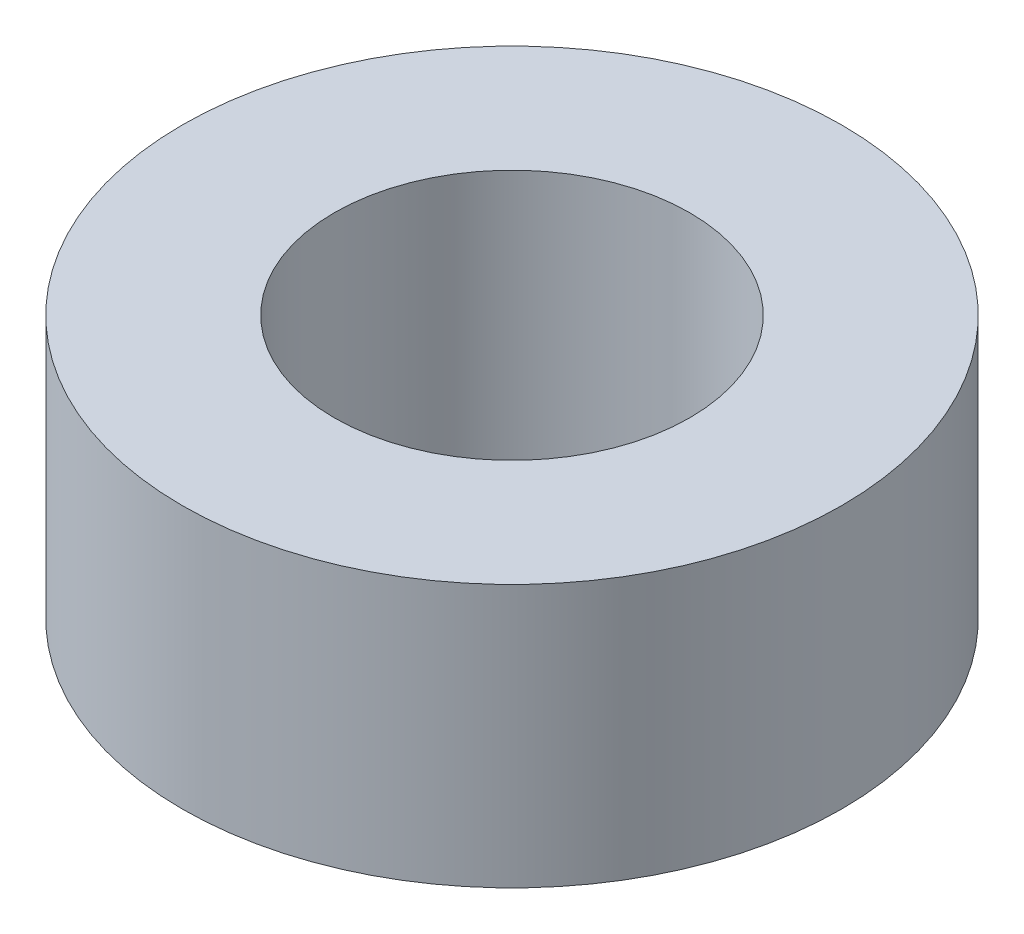
ISO-10303-21;
HEADER;
FILE_DESCRIPTION(('STEP AP214'),'2;1');
FILE_NAME('part.step','',(''),(''),'','','');
FILE_SCHEMA(('AUTOMOTIVE_DESIGN { 1 0 10303 214 1 1 1 1 }'));
ENDSEC;
DATA;
#1=APPLICATION_CONTEXT('core data for automotive mechanical design processes');
#2=APPLICATION_PROTOCOL_DEFINITION('international standard','automotive_design',2000,#1);
#3=PRODUCT_CONTEXT('',#1,'mechanical');
#4=PRODUCT('Part','Part','',(#3));
#5=PRODUCT_RELATED_PRODUCT_CATEGORY('part','',(#4));
#6=PRODUCT_DEFINITION_FORMATION('','',#4);
#7=PRODUCT_DEFINITION_CONTEXT('part definition',#1,'design');
#8=PRODUCT_DEFINITION('design','',#6,#7);
#9=PRODUCT_DEFINITION_SHAPE('','',#8);
#10=(LENGTH_UNIT() NAMED_UNIT(*) SI_UNIT(.MILLI.,.METRE.));
#11=(NAMED_UNIT(*) PLANE_ANGLE_UNIT() SI_UNIT($,.RADIAN.));
#12=(NAMED_UNIT(*) SI_UNIT($,.STERADIAN.) SOLID_ANGLE_UNIT());
#13=UNCERTAINTY_MEASURE_WITH_UNIT(LENGTH_MEASURE(1.E-05),#10,'distance_accuracy_value','');
#14=(GEOMETRIC_REPRESENTATION_CONTEXT(3) GLOBAL_UNCERTAINTY_ASSIGNED_CONTEXT((#13)) GLOBAL_UNIT_ASSIGNED_CONTEXT((#10,
#11,#12)) REPRESENTATION_CONTEXT('',''));
#15=CARTESIAN_POINT('',(0.,0.,0.));
#16=DIRECTION('',(0.,0.,1.));
#17=DIRECTION('',(1.,0.,0.));
#18=AXIS2_PLACEMENT_3D('',#15,#16,#17);
#19=CARTESIAN_POINT('',(0.,15.9419383151855,0.));
#20=DIRECTION('',(0.,-1.,0.));
#21=DIRECTION('',(0.,0.,-1.));
#22=AXIS2_PLACEMENT_3D('',#19,#20,#21);
#23=CYLINDRICAL_SURFACE('',#22,20.);
#24=CARTESIAN_POINT('',(0.,15.9419383151855,0.));
#25=DIRECTION('',(0.,1.,0.));
#26=DIRECTION('',(0.,0.,1.));
#27=AXIS2_PLACEMENT_3D('',#24,#25,#26);
#28=CIRCLE('',#27,20.);
#29=CARTESIAN_POINT('',(0.,15.9419383151855,20.));
#30=VERTEX_POINT('',#29);
#31=EDGE_CURVE('E10',#30,#30,#28,.T.);
#32=ORIENTED_EDGE('',*,*,#31,.F.);
#33=EDGE_LOOP('',(#32));
#34=FACE_BOUND('',#33,.T.);
#35=CARTESIAN_POINT('',(0.,0.,0.));
#36=DIRECTION('',(0.,1.,0.));
#37=DIRECTION('',(0.,0.,1.));
#38=AXIS2_PLACEMENT_3D('',#35,#36,#37);
#39=CIRCLE('',#38,20.);
#40=CARTESIAN_POINT('',(0.,0.,20.));
#41=VERTEX_POINT('',#40);
#42=EDGE_CURVE('E37',#41,#41,#39,.T.);
#43=ORIENTED_EDGE('',*,*,#42,.T.);
#44=EDGE_LOOP('',(#43));
#45=FACE_BOUND('',#44,.T.);
#46=ADVANCED_FACE('F40',(#34,#45),#23,.T.);
#47=CARTESIAN_POINT('',(0.,15.9419383151855,0.));
#48=DIRECTION('',(0.,1.,0.));
#49=DIRECTION('',(0.,0.,1.));
#50=AXIS2_PLACEMENT_3D('',#47,#48,#49);
#51=PLANE('',#50);
#52=CARTESIAN_POINT('',(0.,15.9419383151855,0.));
#53=DIRECTION('',(0.,1.,0.));
#54=DIRECTION('',(0.,0.,1.));
#55=AXIS2_PLACEMENT_3D('',#52,#53,#54);
#56=CIRCLE('',#55,10.7798956576656);
#57=CARTESIAN_POINT('',(0.,15.9419383151855,10.7798956576656));
#58=VERTEX_POINT('',#57);
#59=EDGE_CURVE('E50',#58,#58,#56,.T.);
#60=ORIENTED_EDGE('',*,*,#59,.F.);
#61=EDGE_LOOP('',(#60));
#62=FACE_BOUND('',#61,.T.);
#63=ORIENTED_EDGE('',*,*,#31,.T.);
#64=EDGE_LOOP('',(#63));
#65=FACE_BOUND('',#64,.T.);
#66=ADVANCED_FACE('F59',(#62,#65),#51,.T.);
#67=CARTESIAN_POINT('',(0.,0.,0.));
#68=DIRECTION('',(0.,1.,0.));
#69=DIRECTION('',(0.,0.,1.));
#70=AXIS2_PLACEMENT_3D('',#67,#68,#69);
#71=PLANE('',#70);
#72=CARTESIAN_POINT('',(0.,0.,0.));
#73=DIRECTION('',(0.,1.,0.));
#74=DIRECTION('',(0.,0.,1.));
#75=AXIS2_PLACEMENT_3D('',#72,#73,#74);
#76=CIRCLE('',#75,10.7798956576656);
#77=CARTESIAN_POINT('',(0.,0.,10.7798956576656));
#78=VERTEX_POINT('',#77);
#79=EDGE_CURVE('E47',#78,#78,#76,.T.);
#80=ORIENTED_EDGE('',*,*,#79,.T.);
#81=EDGE_LOOP('',(#80));
#82=FACE_BOUND('',#81,.T.);
#83=ORIENTED_EDGE('',*,*,#42,.F.);
#84=EDGE_LOOP('',(#83));
#85=FACE_BOUND('',#84,.T.);
#86=ADVANCED_FACE('F58',(#82,#85),#71,.F.);
#87=CARTESIAN_POINT('',(0.,15.9419383151855,0.));
#88=DIRECTION('',(0.,-1.,0.));
#89=DIRECTION('',(0.,0.,-1.));
#90=AXIS2_PLACEMENT_3D('',#87,#88,#89);
#91=CYLINDRICAL_SURFACE('',#90,10.7798956576656);
#92=ORIENTED_EDGE('',*,*,#59,.T.);
#93=EDGE_LOOP('',(#92));
#94=FACE_BOUND('',#93,.T.);
#95=ORIENTED_EDGE('',*,*,#79,.F.);
#96=EDGE_LOOP('',(#95));
#97=FACE_BOUND('',#96,.T.);
#98=ADVANCED_FACE('F54',(#94,#97),#91,.F.);
#99=CLOSED_SHELL('',(#46,#66,#86,#98));
#100=MANIFOLD_SOLID_BREP('B2',#99);
#101=ADVANCED_BREP_SHAPE_REPRESENTATION('',(#18,#100),#14);
#102=SHAPE_DEFINITION_REPRESENTATION(#9,#101);
ENDSEC;
END-ISO-10303-21;
